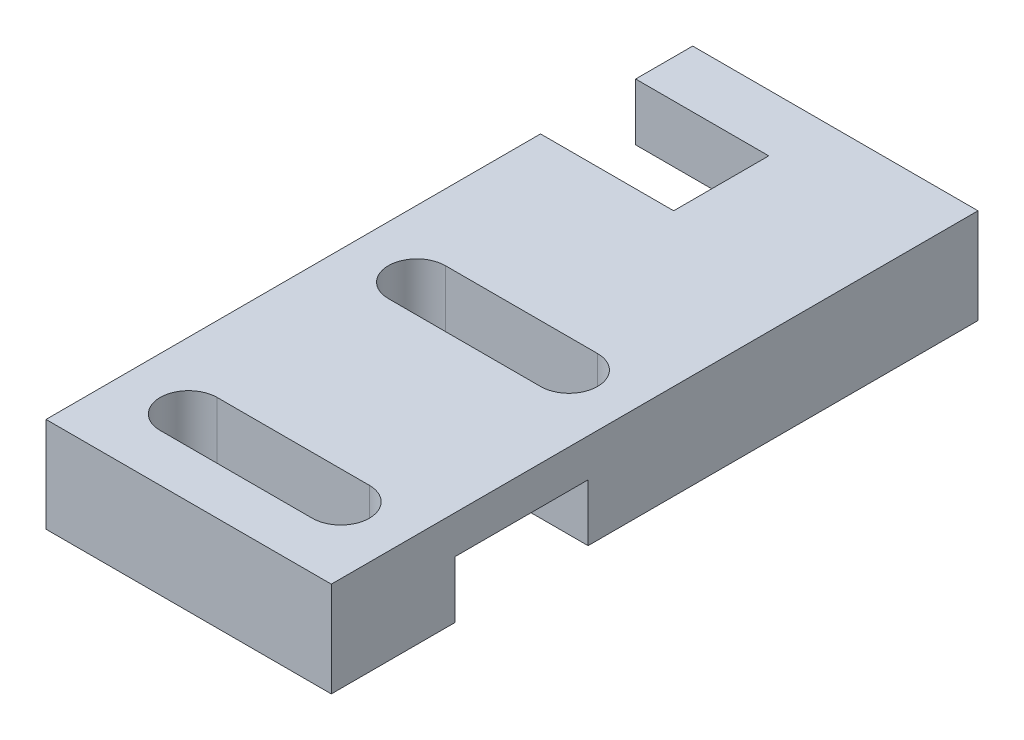
ISO-10303-21;
HEADER;
FILE_DESCRIPTION(('STEP AP214'),'2;1');
FILE_NAME('part.step','',(''),(''),'','','');
FILE_SCHEMA(('AUTOMOTIVE_DESIGN { 1 0 10303 214 1 1 1 1 }'));
ENDSEC;
DATA;
#1=APPLICATION_CONTEXT('core data for automotive mechanical design processes');
#2=APPLICATION_PROTOCOL_DEFINITION('international standard','automotive_design',2000,#1);
#3=PRODUCT_CONTEXT('',#1,'mechanical');
#4=PRODUCT('Part','Part','',(#3));
#5=PRODUCT_RELATED_PRODUCT_CATEGORY('part','',(#4));
#6=PRODUCT_DEFINITION_FORMATION('','',#4);
#7=PRODUCT_DEFINITION_CONTEXT('part definition',#1,'design');
#8=PRODUCT_DEFINITION('design','',#6,#7);
#9=PRODUCT_DEFINITION_SHAPE('','',#8);
#10=(LENGTH_UNIT() NAMED_UNIT(*) SI_UNIT(.MILLI.,.METRE.));
#11=(NAMED_UNIT(*) PLANE_ANGLE_UNIT() SI_UNIT($,.RADIAN.));
#12=(NAMED_UNIT(*) SI_UNIT($,.STERADIAN.) SOLID_ANGLE_UNIT());
#13=UNCERTAINTY_MEASURE_WITH_UNIT(LENGTH_MEASURE(1.E-05),#10,'distance_accuracy_value','');
#14=(GEOMETRIC_REPRESENTATION_CONTEXT(3) GLOBAL_UNCERTAINTY_ASSIGNED_CONTEXT((#13)) GLOBAL_UNIT_ASSIGNED_CONTEXT((#10,
#11,#12)) REPRESENTATION_CONTEXT('',''));
#15=CARTESIAN_POINT('',(0.,0.,0.));
#16=DIRECTION('',(0.,0.,1.));
#17=DIRECTION('',(1.,0.,0.));
#18=AXIS2_PLACEMENT_3D('',#15,#16,#17);
#19=CARTESIAN_POINT('',(0.,0.,0.));
#20=DIRECTION('',(0.,1.,0.));
#21=DIRECTION('',(0.,0.,1.));
#22=AXIS2_PLACEMENT_3D('',#19,#20,#21);
#23=PLANE('',#22);
#24=CARTESIAN_POINT('',(11.5,0.,-16.));
#25=DIRECTION('',(0.,1.,0.));
#26=DIRECTION('',(0.,0.,1.));
#27=AXIS2_PLACEMENT_3D('',#24,#25,#26);
#28=CIRCLE('',#27,1.5);
#29=CARTESIAN_POINT('',(11.5,0.,-14.5));
#30=VERTEX_POINT('',#29);
#31=CARTESIAN_POINT('',(11.5,0.,-17.5));
#32=VERTEX_POINT('',#31);
#33=EDGE_CURVE('E259',#30,#32,#28,.T.);
#34=ORIENTED_EDGE('',*,*,#33,.T.);
#35=DIRECTION('',(1.,0.,0.));
#36=VECTOR('',#35,1.);
#37=CARTESIAN_POINT('',(0.,0.,-17.5));
#38=LINE('',#37,#36);
#39=CARTESIAN_POINT('',(3.5,0.,-17.5));
#40=VERTEX_POINT('',#39);
#41=EDGE_CURVE('E372',#40,#32,#38,.T.);
#42=ORIENTED_EDGE('',*,*,#41,.F.);
#43=CARTESIAN_POINT('',(3.5,0.,-16.));
#44=DIRECTION('',(0.,1.,0.));
#45=DIRECTION('',(0.,0.,1.));
#46=AXIS2_PLACEMENT_3D('',#43,#44,#45);
#47=CIRCLE('',#46,1.5);
#48=CARTESIAN_POINT('',(3.5,0.,-14.5));
#49=VERTEX_POINT('',#48);
#50=EDGE_CURVE('E368',#40,#49,#47,.T.);
#51=ORIENTED_EDGE('',*,*,#50,.T.);
#52=DIRECTION('',(1.,0.,0.));
#53=VECTOR('',#52,1.);
#54=CARTESIAN_POINT('',(0.,0.,-14.5));
#55=LINE('',#54,#53);
#56=EDGE_CURVE('E357',#49,#30,#55,.T.);
#57=ORIENTED_EDGE('',*,*,#56,.T.);
#58=EDGE_LOOP('',(#34,#42,#51,#57));
#59=FACE_BOUND('',#58,.T.);
#60=DIRECTION('',(0.,0.,1.));
#61=VECTOR('',#60,1.);
#62=CARTESIAN_POINT('',(7.,0.,0.));
#63=LINE('',#62,#61);
#64=CARTESIAN_POINT('',(7.,0.,-34.));
#65=VERTEX_POINT('',#64);
#66=CARTESIAN_POINT('',(7.,0.,-26.));
#67=VERTEX_POINT('',#66);
#68=EDGE_CURVE('E298',#65,#67,#63,.T.);
#69=ORIENTED_EDGE('',*,*,#68,.F.);
#70=DIRECTION('',(1.,0.,0.));
#71=VECTOR('',#70,1.);
#72=CARTESIAN_POINT('',(0.,0.,-34.));
#73=LINE('',#72,#71);
#74=CARTESIAN_POINT('',(15.,0.,-34.));
#75=VERTEX_POINT('',#74);
#76=EDGE_CURVE('E113',#65,#75,#73,.T.);
#77=ORIENTED_EDGE('',*,*,#76,.T.);
#78=DIRECTION('',(0.,0.,1.));
#79=VECTOR('',#78,1.);
#80=CARTESIAN_POINT('',(15.,0.,0.));
#81=LINE('',#80,#79);
#82=CARTESIAN_POINT('',(15.,0.,-13.5));
#83=VERTEX_POINT('',#82);
#84=EDGE_CURVE('E306',#75,#83,#81,.T.);
#85=ORIENTED_EDGE('',*,*,#84,.T.);
#86=DIRECTION('',(-1.,0.,0.));
#87=VECTOR('',#86,1.);
#88=CARTESIAN_POINT('',(15.,0.,-13.5));
#89=LINE('',#88,#87);
#90=CARTESIAN_POINT('',(0.,0.,-13.5));
#91=VERTEX_POINT('',#90);
#92=EDGE_CURVE('E243',#83,#91,#89,.T.);
#93=ORIENTED_EDGE('',*,*,#92,.T.);
#94=DIRECTION('',(0.,0.,-1.));
#95=VECTOR('',#94,1.);
#96=CARTESIAN_POINT('',(0.,0.,0.));
#97=LINE('',#96,#95);
#98=CARTESIAN_POINT('',(0.,0.,-26.));
#99=VERTEX_POINT('',#98);
#100=EDGE_CURVE('E399',#91,#99,#97,.T.);
#101=ORIENTED_EDGE('',*,*,#100,.T.);
#102=DIRECTION('',(-1.,0.,0.));
#103=VECTOR('',#102,1.);
#104=CARTESIAN_POINT('',(0.,0.,-26.));
#105=LINE('',#104,#103);
#106=EDGE_CURVE('E395',#67,#99,#105,.T.);
#107=ORIENTED_EDGE('',*,*,#106,.F.);
#108=EDGE_LOOP('',(#69,#77,#85,#93,#101,#107));
#109=FACE_BOUND('',#108,.T.);
#110=ADVANCED_FACE('F38',(#59,#109),#23,.F.);
#111=CARTESIAN_POINT('',(0.,5.,-34.));
#112=DIRECTION('',(0.,0.,-1.));
#113=DIRECTION('',(-1.,0.,0.));
#114=AXIS2_PLACEMENT_3D('',#111,#112,#113);
#115=PLANE('',#114);
#116=DIRECTION('',(0.,-1.,0.));
#117=VECTOR('',#116,1.);
#118=CARTESIAN_POINT('',(7.,2.,-34.));
#119=LINE('',#118,#117);
#120=CARTESIAN_POINT('',(7.,2.,-34.));
#121=VERTEX_POINT('',#120);
#122=EDGE_CURVE('E290',#121,#65,#119,.T.);
#123=ORIENTED_EDGE('',*,*,#122,.F.);
#124=DIRECTION('',(1.,0.,0.));
#125=VECTOR('',#124,1.);
#126=CARTESIAN_POINT('',(-5.00000000000001,2.,-34.));
#127=LINE('',#126,#125);
#128=CARTESIAN_POINT('',(0.,2.,-34.));
#129=VERTEX_POINT('',#128);
#130=EDGE_CURVE('E173',#129,#121,#127,.T.);
#131=ORIENTED_EDGE('',*,*,#130,.F.);
#132=DIRECTION('',(0.,-1.,0.));
#133=VECTOR('',#132,1.);
#134=CARTESIAN_POINT('',(0.,5.,-34.));
#135=LINE('',#134,#133);
#136=CARTESIAN_POINT('',(0.,5.,-34.));
#137=VERTEX_POINT('',#136);
#138=EDGE_CURVE('E166',#137,#129,#135,.T.);
#139=ORIENTED_EDGE('',*,*,#138,.F.);
#140=DIRECTION('',(1.,0.,0.));
#141=VECTOR('',#140,1.);
#142=CARTESIAN_POINT('',(0.,5.,-34.));
#143=LINE('',#142,#141);
#144=CARTESIAN_POINT('',(15.,5.,-34.));
#145=VERTEX_POINT('',#144);
#146=EDGE_CURVE('E170',#137,#145,#143,.T.);
#147=ORIENTED_EDGE('',*,*,#146,.T.);
#148=DIRECTION('',(0.,-1.,0.));
#149=VECTOR('',#148,1.);
#150=CARTESIAN_POINT('',(15.,5.,-34.));
#151=LINE('',#150,#149);
#152=EDGE_CURVE('E178',#145,#75,#151,.T.);
#153=ORIENTED_EDGE('',*,*,#152,.T.);
#154=ORIENTED_EDGE('',*,*,#76,.F.);
#155=EDGE_LOOP('',(#123,#131,#139,#147,#153,#154));
#156=FACE_BOUND('',#155,.T.);
#157=ADVANCED_FACE('F169',(#156),#115,.T.);
#158=CARTESIAN_POINT('',(0.,5.,0.));
#159=DIRECTION('',(-1.,0.,0.));
#160=DIRECTION('',(0.,0.,1.));
#161=AXIS2_PLACEMENT_3D('',#158,#159,#160);
#162=PLANE('',#161);
#163=ORIENTED_EDGE('',*,*,#138,.T.);
#164=DIRECTION('',(0.,0.,1.));
#165=VECTOR('',#164,1.);
#166=CARTESIAN_POINT('',(0.,2.,0.));
#167=LINE('',#166,#165);
#168=CARTESIAN_POINT('',(0.,2.,-31.));
#169=VERTEX_POINT('',#168);
#170=EDGE_CURVE('E273',#129,#169,#167,.T.);
#171=ORIENTED_EDGE('',*,*,#170,.T.);
#172=DIRECTION('',(0.,-1.,0.));
#173=VECTOR('',#172,1.);
#174=CARTESIAN_POINT('',(0.,5.,-31.));
#175=LINE('',#174,#173);
#176=CARTESIAN_POINT('',(0.,5.,-31.));
#177=VERTEX_POINT('',#176);
#178=EDGE_CURVE('E179',#177,#169,#175,.T.);
#179=ORIENTED_EDGE('',*,*,#178,.F.);
#180=DIRECTION('',(0.,0.,-1.));
#181=VECTOR('',#180,1.);
#182=CARTESIAN_POINT('',(0.,5.,0.));
#183=LINE('',#182,#181);
#184=EDGE_CURVE('E183',#177,#137,#183,.T.);
#185=ORIENTED_EDGE('',*,*,#184,.T.);
#186=EDGE_LOOP('',(#163,#171,#179,#185));
#187=FACE_BOUND('',#186,.T.);
#188=ADVANCED_FACE('F189',(#187),#162,.T.);
#189=CARTESIAN_POINT('',(0.,5.,-31.));
#190=DIRECTION('',(0.,0.,-1.));
#191=DIRECTION('',(-1.,0.,0.));
#192=AXIS2_PLACEMENT_3D('',#189,#190,#191);
#193=PLANE('',#192);
#194=DIRECTION('',(-1.,0.,0.));
#195=VECTOR('',#194,1.);
#196=CARTESIAN_POINT('',(0.,2.,-31.));
#197=LINE('',#196,#195);
#198=CARTESIAN_POINT('',(7.,2.,-31.));
#199=VERTEX_POINT('',#198);
#200=EDGE_CURVE('E11',#199,#169,#197,.T.);
#201=ORIENTED_EDGE('',*,*,#200,.F.);
#202=DIRECTION('',(0.,-1.,0.));
#203=VECTOR('',#202,1.);
#204=CARTESIAN_POINT('',(7.,5.,-31.));
#205=LINE('',#204,#203);
#206=CARTESIAN_POINT('',(7.,5.,-31.));
#207=VERTEX_POINT('',#206);
#208=EDGE_CURVE('E313',#207,#199,#205,.T.);
#209=ORIENTED_EDGE('',*,*,#208,.F.);
#210=DIRECTION('',(1.,0.,0.));
#211=VECTOR('',#210,1.);
#212=CARTESIAN_POINT('',(0.,5.,-31.));
#213=LINE('',#212,#211);
#214=EDGE_CURVE('E63',#177,#207,#213,.T.);
#215=ORIENTED_EDGE('',*,*,#214,.F.);
#216=ORIENTED_EDGE('',*,*,#178,.T.);
#217=EDGE_LOOP('',(#201,#209,#215,#216));
#218=FACE_BOUND('',#217,.T.);
#219=ADVANCED_FACE('F442',(#218),#193,.F.);
#220=CARTESIAN_POINT('',(7.,5.,0.));
#221=DIRECTION('',(1.,0.,0.));
#222=DIRECTION('',(0.,0.,-1.));
#223=AXIS2_PLACEMENT_3D('',#220,#221,#222);
#224=PLANE('',#223);
#225=ORIENTED_EDGE('',*,*,#68,.T.);
#226=DIRECTION('',(0.,-1.,0.));
#227=VECTOR('',#226,1.);
#228=CARTESIAN_POINT('',(7.,5.,-26.));
#229=LINE('',#228,#227);
#230=CARTESIAN_POINT('',(7.,5.,-26.));
#231=VERTEX_POINT('',#230);
#232=EDGE_CURVE('E47',#231,#67,#229,.T.);
#233=ORIENTED_EDGE('',*,*,#232,.F.);
#234=DIRECTION('',(0.,0.,1.));
#235=VECTOR('',#234,1.);
#236=CARTESIAN_POINT('',(7.,5.,0.));
#237=LINE('',#236,#235);
#238=EDGE_CURVE('E209',#207,#231,#237,.T.);
#239=ORIENTED_EDGE('',*,*,#238,.F.);
#240=ORIENTED_EDGE('',*,*,#208,.T.);
#241=DIRECTION('',(0.,0.,-1.));
#242=VECTOR('',#241,1.);
#243=CARTESIAN_POINT('',(7.,2.,-34.));
#244=LINE('',#243,#242);
#245=EDGE_CURVE('E286',#199,#121,#244,.T.);
#246=ORIENTED_EDGE('',*,*,#245,.T.);
#247=ORIENTED_EDGE('',*,*,#122,.T.);
#248=EDGE_LOOP('',(#225,#233,#239,#240,#246,#247));
#249=FACE_BOUND('',#248,.T.);
#250=ADVANCED_FACE('F296',(#249),#224,.F.);
#251=CARTESIAN_POINT('',(0.,5.,-26.));
#252=DIRECTION('',(0.,0.,1.));
#253=DIRECTION('',(1.,0.,0.));
#254=AXIS2_PLACEMENT_3D('',#251,#252,#253);
#255=PLANE('',#254);
#256=ORIENTED_EDGE('',*,*,#106,.T.);
#257=DIRECTION('',(0.,-1.,0.));
#258=VECTOR('',#257,1.);
#259=CARTESIAN_POINT('',(0.,5.,-26.));
#260=LINE('',#259,#258);
#261=CARTESIAN_POINT('',(0.,5.,-26.));
#262=VERTEX_POINT('',#261);
#263=EDGE_CURVE('E328',#262,#99,#260,.T.);
#264=ORIENTED_EDGE('',*,*,#263,.F.);
#265=DIRECTION('',(-1.,0.,0.));
#266=VECTOR('',#265,1.);
#267=CARTESIAN_POINT('',(0.,5.,-26.));
#268=LINE('',#267,#266);
#269=EDGE_CURVE('E202',#231,#262,#268,.T.);
#270=ORIENTED_EDGE('',*,*,#269,.F.);
#271=ORIENTED_EDGE('',*,*,#232,.T.);
#272=EDGE_LOOP('',(#256,#264,#270,#271));
#273=FACE_BOUND('',#272,.T.);
#274=ADVANCED_FACE('F445',(#273),#255,.F.);
#275=DIRECTION('',(0.,-1.,0.));
#276=VECTOR('',#275,1.);
#277=CARTESIAN_POINT('',(0.,3.,-13.5));
#278=LINE('',#277,#276);
#279=CARTESIAN_POINT('',(0.,3.,-13.5));
#280=VERTEX_POINT('',#279);
#281=EDGE_CURVE('E269',#280,#91,#278,.T.);
#282=ORIENTED_EDGE('',*,*,#281,.F.);
#283=DIRECTION('',(0.,0.,-1.));
#284=VECTOR('',#283,1.);
#285=CARTESIAN_POINT('',(0.,3.,-13.5));
#286=LINE('',#285,#284);
#287=CARTESIAN_POINT('',(0.,3.,-6.5));
#288=VERTEX_POINT('',#287);
#289=EDGE_CURVE('E260',#288,#280,#286,.T.);
#290=ORIENTED_EDGE('',*,*,#289,.F.);
#291=DIRECTION('',(0.,1.,0.));
#292=VECTOR('',#291,1.);
#293=CARTESIAN_POINT('',(0.,3.,-6.5));
#294=LINE('',#293,#292);
#295=CARTESIAN_POINT('',(0.,0.,-6.5));
#296=VERTEX_POINT('',#295);
#297=EDGE_CURVE('E265',#296,#288,#294,.T.);
#298=ORIENTED_EDGE('',*,*,#297,.F.);
#299=CARTESIAN_POINT('',(0.,0.,0.));
#300=VERTEX_POINT('',#299);
#301=EDGE_CURVE('E400',#300,#296,#97,.T.);
#302=ORIENTED_EDGE('',*,*,#301,.F.);
#303=DIRECTION('',(0.,-1.,0.));
#304=VECTOR('',#303,1.);
#305=CARTESIAN_POINT('',(0.,5.,0.));
#306=LINE('',#305,#304);
#307=CARTESIAN_POINT('',(0.,5.,0.));
#308=VERTEX_POINT('',#307);
#309=EDGE_CURVE('E325',#308,#300,#306,.T.);
#310=ORIENTED_EDGE('',*,*,#309,.F.);
#311=EDGE_CURVE('E193',#308,#262,#183,.T.);
#312=ORIENTED_EDGE('',*,*,#311,.T.);
#313=ORIENTED_EDGE('',*,*,#263,.T.);
#314=ORIENTED_EDGE('',*,*,#100,.F.);
#315=EDGE_LOOP('',(#282,#290,#298,#302,#310,#312,#313,#314));
#316=FACE_BOUND('',#315,.T.);
#317=ADVANCED_FACE('F418',(#316),#162,.T.);
#318=CARTESIAN_POINT('',(0.,5.,0.));
#319=DIRECTION('',(0.,0.,1.));
#320=DIRECTION('',(1.,0.,0.));
#321=AXIS2_PLACEMENT_3D('',#318,#319,#320);
#322=PLANE('',#321);
#323=DIRECTION('',(-1.,0.,0.));
#324=VECTOR('',#323,1.);
#325=CARTESIAN_POINT('',(0.,0.,0.));
#326=LINE('',#325,#324);
#327=CARTESIAN_POINT('',(15.,0.,0.));
#328=VERTEX_POINT('',#327);
#329=EDGE_CURVE('E403',#328,#300,#326,.T.);
#330=ORIENTED_EDGE('',*,*,#329,.F.);
#331=DIRECTION('',(0.,-1.,0.));
#332=VECTOR('',#331,1.);
#333=CARTESIAN_POINT('',(15.,5.,0.));
#334=LINE('',#333,#332);
#335=CARTESIAN_POINT('',(15.,5.,0.));
#336=VERTEX_POINT('',#335);
#337=EDGE_CURVE('E321',#336,#328,#334,.T.);
#338=ORIENTED_EDGE('',*,*,#337,.F.);
#339=DIRECTION('',(-1.,0.,0.));
#340=VECTOR('',#339,1.);
#341=CARTESIAN_POINT('',(0.,5.,0.));
#342=LINE('',#341,#340);
#343=EDGE_CURVE('E201',#336,#308,#342,.T.);
#344=ORIENTED_EDGE('',*,*,#343,.T.);
#345=ORIENTED_EDGE('',*,*,#309,.T.);
#346=EDGE_LOOP('',(#330,#338,#344,#345));
#347=FACE_BOUND('',#346,.T.);
#348=ADVANCED_FACE('F414',(#347),#322,.T.);
#349=CARTESIAN_POINT('',(15.,5.,0.));
#350=DIRECTION('',(1.,0.,0.));
#351=DIRECTION('',(0.,0.,-1.));
#352=AXIS2_PLACEMENT_3D('',#349,#350,#351);
#353=PLANE('',#352);
#354=DIRECTION('',(0.,-1.,0.));
#355=VECTOR('',#354,1.);
#356=CARTESIAN_POINT('',(15.,3.,-13.5));
#357=LINE('',#356,#355);
#358=CARTESIAN_POINT('',(15.,3.,-13.5));
#359=VERTEX_POINT('',#358);
#360=EDGE_CURVE('E264',#359,#83,#357,.T.);
#361=ORIENTED_EDGE('',*,*,#360,.T.);
#362=ORIENTED_EDGE('',*,*,#84,.F.);
#363=ORIENTED_EDGE('',*,*,#152,.F.);
#364=DIRECTION('',(0.,0.,1.));
#365=VECTOR('',#364,1.);
#366=CARTESIAN_POINT('',(15.,5.,0.));
#367=LINE('',#366,#365);
#368=EDGE_CURVE('E186',#145,#336,#367,.T.);
#369=ORIENTED_EDGE('',*,*,#368,.T.);
#370=ORIENTED_EDGE('',*,*,#337,.T.);
#371=CARTESIAN_POINT('',(15.,0.,-6.5));
#372=VERTEX_POINT('',#371);
#373=EDGE_CURVE('E309',#372,#328,#81,.T.);
#374=ORIENTED_EDGE('',*,*,#373,.F.);
#375=DIRECTION('',(0.,1.,0.));
#376=VECTOR('',#375,1.);
#377=CARTESIAN_POINT('',(15.,3.,-6.5));
#378=LINE('',#377,#376);
#379=CARTESIAN_POINT('',(15.,3.,-6.5));
#380=VERTEX_POINT('',#379);
#381=EDGE_CURVE('E54',#372,#380,#378,.T.);
#382=ORIENTED_EDGE('',*,*,#381,.T.);
#383=DIRECTION('',(0.,0.,-1.));
#384=VECTOR('',#383,1.);
#385=CARTESIAN_POINT('',(15.,3.,-13.5));
#386=LINE('',#385,#384);
#387=EDGE_CURVE('E248',#380,#359,#386,.T.);
#388=ORIENTED_EDGE('',*,*,#387,.T.);
#389=EDGE_LOOP('',(#361,#362,#363,#369,#370,#374,#382,#388));
#390=FACE_BOUND('',#389,.T.);
#391=ADVANCED_FACE('F412',(#390),#353,.T.);
#392=CARTESIAN_POINT('',(11.5,5.,-4.));
#393=DIRECTION('',(0.,-1.,0.));
#394=DIRECTION('',(0.,0.,-1.));
#395=AXIS2_PLACEMENT_3D('',#392,#393,#394);
#396=CYLINDRICAL_SURFACE('',#395,1.5);
#397=CARTESIAN_POINT('',(11.5,0.,-4.));
#398=DIRECTION('',(0.,1.,0.));
#399=DIRECTION('',(0.,0.,1.));
#400=AXIS2_PLACEMENT_3D('',#397,#398,#399);
#401=CIRCLE('',#400,1.5);
#402=CARTESIAN_POINT('',(11.5,0.,-2.5));
#403=VERTEX_POINT('',#402);
#404=CARTESIAN_POINT('',(11.5,0.,-5.5));
#405=VERTEX_POINT('',#404);
#406=EDGE_CURVE('E377',#403,#405,#401,.T.);
#407=ORIENTED_EDGE('',*,*,#406,.F.);
#408=DIRECTION('',(0.,-1.,0.));
#409=VECTOR('',#408,1.);
#410=CARTESIAN_POINT('',(11.5,5.,-2.5));
#411=LINE('',#410,#409);
#412=CARTESIAN_POINT('',(11.5,5.,-2.5));
#413=VERTEX_POINT('',#412);
#414=EDGE_CURVE('E316',#413,#403,#411,.T.);
#415=ORIENTED_EDGE('',*,*,#414,.F.);
#416=CARTESIAN_POINT('',(11.5,5.,-4.));
#417=DIRECTION('',(0.,1.,0.));
#418=DIRECTION('',(0.,0.,1.));
#419=AXIS2_PLACEMENT_3D('',#416,#417,#418);
#420=CIRCLE('',#419,1.5);
#421=CARTESIAN_POINT('',(11.5,5.,-5.5));
#422=VERTEX_POINT('',#421);
#423=EDGE_CURVE('E225',#413,#422,#420,.T.);
#424=ORIENTED_EDGE('',*,*,#423,.T.);
#425=DIRECTION('',(0.,-1.,0.));
#426=VECTOR('',#425,1.);
#427=CARTESIAN_POINT('',(11.5,5.,-5.5));
#428=LINE('',#427,#426);
#429=EDGE_CURVE('E334',#422,#405,#428,.T.);
#430=ORIENTED_EDGE('',*,*,#429,.T.);
#431=EDGE_LOOP('',(#407,#415,#424,#430));
#432=FACE_BOUND('',#431,.T.);
#433=ADVANCED_FACE('F486',(#432),#396,.F.);
#434=CARTESIAN_POINT('',(0.,5.,-2.49999999999999));
#435=DIRECTION('',(0.,0.,-1.));
#436=DIRECTION('',(-1.,0.,0.));
#437=AXIS2_PLACEMENT_3D('',#434,#435,#436);
#438=PLANE('',#437);
#439=DIRECTION('',(1.,0.,0.));
#440=VECTOR('',#439,1.);
#441=CARTESIAN_POINT('',(0.,0.,-2.49999999999999));
#442=LINE('',#441,#440);
#443=CARTESIAN_POINT('',(3.5,0.,-2.5));
#444=VERTEX_POINT('',#443);
#445=EDGE_CURVE('E381',#444,#403,#442,.T.);
#446=ORIENTED_EDGE('',*,*,#445,.F.);
#447=DIRECTION('',(0.,-1.,0.));
#448=VECTOR('',#447,1.);
#449=CARTESIAN_POINT('',(3.5,5.,-2.5));
#450=LINE('',#449,#448);
#451=CARTESIAN_POINT('',(3.5,5.,-2.5));
#452=VERTEX_POINT('',#451);
#453=EDGE_CURVE('E340',#452,#444,#450,.T.);
#454=ORIENTED_EDGE('',*,*,#453,.F.);
#455=DIRECTION('',(1.,0.,0.));
#456=VECTOR('',#455,1.);
#457=CARTESIAN_POINT('',(0.,5.,-2.49999999999999));
#458=LINE('',#457,#456);
#459=EDGE_CURVE('E221',#452,#413,#458,.T.);
#460=ORIENTED_EDGE('',*,*,#459,.T.);
#461=ORIENTED_EDGE('',*,*,#414,.T.);
#462=EDGE_LOOP('',(#446,#454,#460,#461));
#463=FACE_BOUND('',#462,.T.);
#464=ADVANCED_FACE('F497',(#463),#438,.T.);
#465=CARTESIAN_POINT('',(3.5,5.,-4.));
#466=DIRECTION('',(0.,-1.,0.));
#467=DIRECTION('',(0.,0.,-1.));
#468=AXIS2_PLACEMENT_3D('',#465,#466,#467);
#469=CYLINDRICAL_SURFACE('',#468,1.5);
#470=CARTESIAN_POINT('',(3.5,0.,-4.));
#471=DIRECTION('',(0.,1.,0.));
#472=DIRECTION('',(0.,0.,1.));
#473=AXIS2_PLACEMENT_3D('',#470,#471,#472);
#474=CIRCLE('',#473,1.5);
#475=CARTESIAN_POINT('',(3.5,0.,-5.5));
#476=VERTEX_POINT('',#475);
#477=EDGE_CURVE('E385',#476,#444,#474,.T.);
#478=ORIENTED_EDGE('',*,*,#477,.F.);
#479=DIRECTION('',(0.,-1.,0.));
#480=VECTOR('',#479,1.);
#481=CARTESIAN_POINT('',(3.5,5.,-5.5));
#482=LINE('',#481,#480);
#483=CARTESIAN_POINT('',(3.5,5.,-5.5));
#484=VERTEX_POINT('',#483);
#485=EDGE_CURVE('E337',#484,#476,#482,.T.);
#486=ORIENTED_EDGE('',*,*,#485,.F.);
#487=CARTESIAN_POINT('',(3.5,5.,-4.));
#488=DIRECTION('',(0.,1.,0.));
#489=DIRECTION('',(0.,0.,1.));
#490=AXIS2_PLACEMENT_3D('',#487,#488,#489);
#491=CIRCLE('',#490,1.5);
#492=EDGE_CURVE('E217',#484,#452,#491,.T.);
#493=ORIENTED_EDGE('',*,*,#492,.T.);
#494=ORIENTED_EDGE('',*,*,#453,.T.);
#495=EDGE_LOOP('',(#478,#486,#493,#494));
#496=FACE_BOUND('',#495,.T.);
#497=ADVANCED_FACE('F494',(#496),#469,.F.);
#498=CARTESIAN_POINT('',(11.5,5.,-16.));
#499=DIRECTION('',(0.,-1.,0.));
#500=DIRECTION('',(0.,0.,-1.));
#501=AXIS2_PLACEMENT_3D('',#498,#499,#500);
#502=CYLINDRICAL_SURFACE('',#501,1.5);
#503=ORIENTED_EDGE('',*,*,#33,.F.);
#504=DIRECTION('',(0.,-1.,0.));
#505=VECTOR('',#504,1.);
#506=CARTESIAN_POINT('',(11.5,5.,-14.5));
#507=LINE('',#506,#505);
#508=CARTESIAN_POINT('',(11.5,5.,-14.5));
#509=VERTEX_POINT('',#508);
#510=EDGE_CURVE('E121',#509,#30,#507,.T.);
#511=ORIENTED_EDGE('',*,*,#510,.F.);
#512=CARTESIAN_POINT('',(11.5,5.,-16.));
#513=DIRECTION('',(0.,1.,0.));
#514=DIRECTION('',(0.,0.,1.));
#515=AXIS2_PLACEMENT_3D('',#512,#513,#514);
#516=CIRCLE('',#515,1.5);
#517=CARTESIAN_POINT('',(11.5,5.,-17.5));
#518=VERTEX_POINT('',#517);
#519=EDGE_CURVE('E240',#509,#518,#516,.T.);
#520=ORIENTED_EDGE('',*,*,#519,.T.);
#521=DIRECTION('',(0.,-1.,0.));
#522=VECTOR('',#521,1.);
#523=CARTESIAN_POINT('',(11.5,5.,-17.5));
#524=LINE('',#523,#522);
#525=EDGE_CURVE('E195',#518,#32,#524,.T.);
#526=ORIENTED_EDGE('',*,*,#525,.T.);
#527=EDGE_LOOP('',(#503,#511,#520,#526));
#528=FACE_BOUND('',#527,.T.);
#529=ADVANCED_FACE('F40',(#528),#502,.F.);
#530=CARTESIAN_POINT('',(0.,5.,-14.5));
#531=DIRECTION('',(0.,0.,-1.));
#532=DIRECTION('',(-1.,0.,0.));
#533=AXIS2_PLACEMENT_3D('',#530,#531,#532);
#534=PLANE('',#533);
#535=ORIENTED_EDGE('',*,*,#56,.F.);
#536=DIRECTION('',(0.,-1.,0.));
#537=VECTOR('',#536,1.);
#538=CARTESIAN_POINT('',(3.5,5.,-14.5));
#539=LINE('',#538,#537);
#540=CARTESIAN_POINT('',(3.5,5.,-14.5));
#541=VERTEX_POINT('',#540);
#542=EDGE_CURVE('E350',#541,#49,#539,.T.);
#543=ORIENTED_EDGE('',*,*,#542,.F.);
#544=DIRECTION('',(1.,0.,0.));
#545=VECTOR('',#544,1.);
#546=CARTESIAN_POINT('',(0.,5.,-14.5));
#547=LINE('',#546,#545);
#548=EDGE_CURVE('E236',#541,#509,#547,.T.);
#549=ORIENTED_EDGE('',*,*,#548,.T.);
#550=ORIENTED_EDGE('',*,*,#510,.T.);
#551=EDGE_LOOP('',(#535,#543,#549,#550));
#552=FACE_BOUND('',#551,.T.);
#553=ADVANCED_FACE('F355',(#552),#534,.T.);
#554=CARTESIAN_POINT('',(3.5,5.,-16.));
#555=DIRECTION('',(0.,-1.,0.));
#556=DIRECTION('',(0.,0.,-1.));
#557=AXIS2_PLACEMENT_3D('',#554,#555,#556);
#558=CYLINDRICAL_SURFACE('',#557,1.5);
#559=ORIENTED_EDGE('',*,*,#50,.F.);
#560=DIRECTION('',(0.,-1.,0.));
#561=VECTOR('',#560,1.);
#562=CARTESIAN_POINT('',(3.5,5.,-17.5));
#563=LINE('',#562,#561);
#564=CARTESIAN_POINT('',(3.5,5.,-17.5));
#565=VERTEX_POINT('',#564);
#566=EDGE_CURVE('E347',#565,#40,#563,.T.);
#567=ORIENTED_EDGE('',*,*,#566,.F.);
#568=CARTESIAN_POINT('',(3.5,5.,-16.));
#569=DIRECTION('',(0.,1.,0.));
#570=DIRECTION('',(0.,0.,1.));
#571=AXIS2_PLACEMENT_3D('',#568,#569,#570);
#572=CIRCLE('',#571,1.5);
#573=EDGE_CURVE('E232',#565,#541,#572,.T.);
#574=ORIENTED_EDGE('',*,*,#573,.T.);
#575=ORIENTED_EDGE('',*,*,#542,.T.);
#576=EDGE_LOOP('',(#559,#567,#574,#575));
#577=FACE_BOUND('',#576,.T.);
#578=ADVANCED_FACE('F512',(#577),#558,.F.);
#579=CARTESIAN_POINT('',(0.,5.,-5.5));
#580=DIRECTION('',(0.,0.,-1.));
#581=DIRECTION('',(-1.,0.,0.));
#582=AXIS2_PLACEMENT_3D('',#579,#580,#581);
#583=PLANE('',#582);
#584=DIRECTION('',(1.,0.,0.));
#585=VECTOR('',#584,1.);
#586=CARTESIAN_POINT('',(0.,0.,-5.5));
#587=LINE('',#586,#585);
#588=EDGE_CURVE('E389',#476,#405,#587,.T.);
#589=ORIENTED_EDGE('',*,*,#588,.T.);
#590=ORIENTED_EDGE('',*,*,#429,.F.);
#591=DIRECTION('',(1.,0.,0.));
#592=VECTOR('',#591,1.);
#593=CARTESIAN_POINT('',(0.,5.,-5.5));
#594=LINE('',#593,#592);
#595=EDGE_CURVE('E212',#484,#422,#594,.T.);
#596=ORIENTED_EDGE('',*,*,#595,.F.);
#597=ORIENTED_EDGE('',*,*,#485,.T.);
#598=EDGE_LOOP('',(#589,#590,#596,#597));
#599=FACE_BOUND('',#598,.T.);
#600=ADVANCED_FACE('F491',(#599),#583,.F.);
#601=CARTESIAN_POINT('',(0.,5.,-17.5));
#602=DIRECTION('',(0.,0.,-1.));
#603=DIRECTION('',(-1.,0.,0.));
#604=AXIS2_PLACEMENT_3D('',#601,#602,#603);
#605=PLANE('',#604);
#606=ORIENTED_EDGE('',*,*,#41,.T.);
#607=ORIENTED_EDGE('',*,*,#525,.F.);
#608=DIRECTION('',(1.,0.,0.));
#609=VECTOR('',#608,1.);
#610=CARTESIAN_POINT('',(0.,5.,-17.5));
#611=LINE('',#610,#609);
#612=EDGE_CURVE('E229',#565,#518,#611,.T.);
#613=ORIENTED_EDGE('',*,*,#612,.F.);
#614=ORIENTED_EDGE('',*,*,#566,.T.);
#615=EDGE_LOOP('',(#606,#607,#613,#614));
#616=FACE_BOUND('',#615,.T.);
#617=ADVANCED_FACE('F479',(#616),#605,.F.);
#618=CARTESIAN_POINT('',(0.,5.,0.));
#619=DIRECTION('',(0.,1.,0.));
#620=DIRECTION('',(0.,0.,1.));
#621=AXIS2_PLACEMENT_3D('',#618,#619,#620);
#622=PLANE('',#621);
#623=ORIENTED_EDGE('',*,*,#519,.F.);
#624=ORIENTED_EDGE('',*,*,#548,.F.);
#625=ORIENTED_EDGE('',*,*,#573,.F.);
#626=ORIENTED_EDGE('',*,*,#612,.T.);
#627=EDGE_LOOP('',(#623,#624,#625,#626));
#628=FACE_BOUND('',#627,.T.);
#629=ORIENTED_EDGE('',*,*,#423,.F.);
#630=ORIENTED_EDGE('',*,*,#459,.F.);
#631=ORIENTED_EDGE('',*,*,#492,.F.);
#632=ORIENTED_EDGE('',*,*,#595,.T.);
#633=EDGE_LOOP('',(#629,#630,#631,#632));
#634=FACE_BOUND('',#633,.T.);
#635=ORIENTED_EDGE('',*,*,#238,.T.);
#636=ORIENTED_EDGE('',*,*,#269,.T.);
#637=ORIENTED_EDGE('',*,*,#311,.F.);
#638=ORIENTED_EDGE('',*,*,#343,.F.);
#639=ORIENTED_EDGE('',*,*,#368,.F.);
#640=ORIENTED_EDGE('',*,*,#146,.F.);
#641=ORIENTED_EDGE('',*,*,#184,.F.);
#642=ORIENTED_EDGE('',*,*,#214,.T.);
#643=EDGE_LOOP('',(#635,#636,#637,#638,#639,#640,#641,#642));
#644=FACE_BOUND('',#643,.T.);
#645=ADVANCED_FACE('F182',(#628,#634,#644),#622,.T.);
#646=ORIENTED_EDGE('',*,*,#406,.T.);
#647=ORIENTED_EDGE('',*,*,#588,.F.);
#648=ORIENTED_EDGE('',*,*,#477,.T.);
#649=ORIENTED_EDGE('',*,*,#445,.T.);
#650=EDGE_LOOP('',(#646,#647,#648,#649));
#651=FACE_BOUND('',#650,.T.);
#652=ORIENTED_EDGE('',*,*,#301,.T.);
#653=DIRECTION('',(-1.,0.,0.));
#654=VECTOR('',#653,1.);
#655=CARTESIAN_POINT('',(15.,0.,-6.5));
#656=LINE('',#655,#654);
#657=EDGE_CURVE('E247',#372,#296,#656,.T.);
#658=ORIENTED_EDGE('',*,*,#657,.F.);
#659=ORIENTED_EDGE('',*,*,#373,.T.);
#660=ORIENTED_EDGE('',*,*,#329,.T.);
#661=EDGE_LOOP('',(#652,#658,#659,#660));
#662=FACE_BOUND('',#661,.T.);
#663=ADVANCED_FACE('F410',(#651,#662),#23,.F.);
#664=CARTESIAN_POINT('',(15.,3.,-13.5));
#665=DIRECTION('',(0.,0.,-1.));
#666=DIRECTION('',(0.,1.,0.));
#667=AXIS2_PLACEMENT_3D('',#664,#665,#666);
#668=PLANE('',#667);
#669=ORIENTED_EDGE('',*,*,#281,.T.);
#670=ORIENTED_EDGE('',*,*,#92,.F.);
#671=ORIENTED_EDGE('',*,*,#360,.F.);
#672=DIRECTION('',(-1.,0.,0.));
#673=VECTOR('',#672,1.);
#674=CARTESIAN_POINT('',(15.,3.,-13.5));
#675=LINE('',#674,#673);
#676=EDGE_CURVE('E255',#359,#280,#675,.T.);
#677=ORIENTED_EDGE('',*,*,#676,.T.);
#678=EDGE_LOOP('',(#669,#670,#671,#677));
#679=FACE_BOUND('',#678,.T.);
#680=ADVANCED_FACE('F450',(#679),#668,.F.);
#681=CARTESIAN_POINT('',(15.,3.,-13.5));
#682=DIRECTION('',(0.,1.,0.));
#683=DIRECTION('',(0.,0.,1.));
#684=AXIS2_PLACEMENT_3D('',#681,#682,#683);
#685=PLANE('',#684);
#686=ORIENTED_EDGE('',*,*,#289,.T.);
#687=ORIENTED_EDGE('',*,*,#676,.F.);
#688=ORIENTED_EDGE('',*,*,#387,.F.);
#689=DIRECTION('',(-1.,0.,0.));
#690=VECTOR('',#689,1.);
#691=CARTESIAN_POINT('',(15.,3.,-6.5));
#692=LINE('',#691,#690);
#693=EDGE_CURVE('E251',#380,#288,#692,.T.);
#694=ORIENTED_EDGE('',*,*,#693,.T.);
#695=EDGE_LOOP('',(#686,#687,#688,#694));
#696=FACE_BOUND('',#695,.T.);
#697=ADVANCED_FACE('F453',(#696),#685,.F.);
#698=CARTESIAN_POINT('',(15.,3.,-6.5));
#699=DIRECTION('',(0.,0.,1.));
#700=DIRECTION('',(1.,0.,0.));
#701=AXIS2_PLACEMENT_3D('',#698,#699,#700);
#702=PLANE('',#701);
#703=ORIENTED_EDGE('',*,*,#297,.T.);
#704=ORIENTED_EDGE('',*,*,#693,.F.);
#705=ORIENTED_EDGE('',*,*,#381,.F.);
#706=ORIENTED_EDGE('',*,*,#657,.T.);
#707=EDGE_LOOP('',(#703,#704,#705,#706));
#708=FACE_BOUND('',#707,.T.);
#709=ADVANCED_FACE('F454',(#708),#702,.F.);
#710=CARTESIAN_POINT('',(-5.00000000000001,2.,-34.));
#711=DIRECTION('',(0.,-1.,0.));
#712=DIRECTION('',(0.,0.,-1.));
#713=AXIS2_PLACEMENT_3D('',#710,#711,#712);
#714=PLANE('',#713);
#715=ORIENTED_EDGE('',*,*,#130,.T.);
#716=ORIENTED_EDGE('',*,*,#245,.F.);
#717=ORIENTED_EDGE('',*,*,#200,.T.);
#718=ORIENTED_EDGE('',*,*,#170,.F.);
#719=EDGE_LOOP('',(#715,#716,#717,#718));
#720=FACE_BOUND('',#719,.T.);
#721=ADVANCED_FACE('F440',(#720),#714,.T.);
#722=CLOSED_SHELL('',(#110,#157,#188,#219,#250,#274,#317,#348,#391,#433,#464,#497,#529,#553,
#578,#600,#617,#645,#663,#680,#697,#709,#721));
#723=MANIFOLD_SOLID_BREP('B2',#722);
#724=ADVANCED_BREP_SHAPE_REPRESENTATION('',(#18,#723),#14);
#725=SHAPE_DEFINITION_REPRESENTATION(#9,#724);
ENDSEC;
END-ISO-10303-21;
